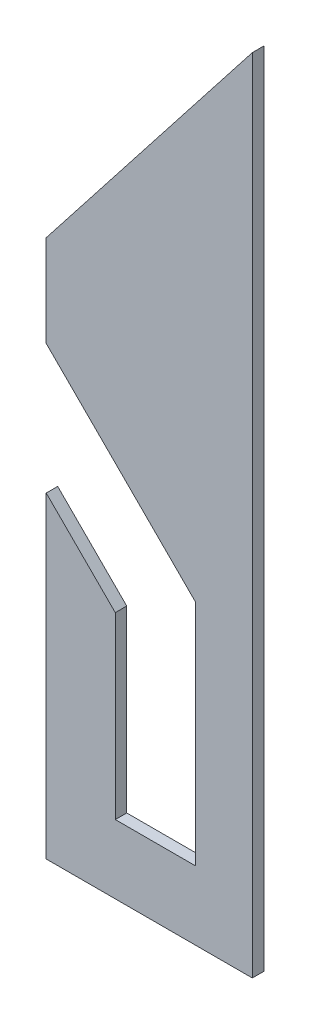
ISO-10303-21;
HEADER;
FILE_DESCRIPTION(('STEP AP214'),'2;1');
FILE_NAME('part.step','',(''),(''),'','','');
FILE_SCHEMA(('AUTOMOTIVE_DESIGN { 1 0 10303 214 1 1 1 1 }'));
ENDSEC;
DATA;
#1=APPLICATION_CONTEXT('core data for automotive mechanical design processes');
#2=APPLICATION_PROTOCOL_DEFINITION('international standard','automotive_design',2000,#1);
#3=PRODUCT_CONTEXT('',#1,'mechanical');
#4=PRODUCT('Part','Part','',(#3));
#5=PRODUCT_RELATED_PRODUCT_CATEGORY('part','',(#4));
#6=PRODUCT_DEFINITION_FORMATION('','',#4);
#7=PRODUCT_DEFINITION_CONTEXT('part definition',#1,'design');
#8=PRODUCT_DEFINITION('design','',#6,#7);
#9=PRODUCT_DEFINITION_SHAPE('','',#8);
#10=(LENGTH_UNIT() NAMED_UNIT(*) SI_UNIT(.MILLI.,.METRE.));
#11=(NAMED_UNIT(*) PLANE_ANGLE_UNIT() SI_UNIT($,.RADIAN.));
#12=(NAMED_UNIT(*) SI_UNIT($,.STERADIAN.) SOLID_ANGLE_UNIT());
#13=UNCERTAINTY_MEASURE_WITH_UNIT(LENGTH_MEASURE(1.E-05),#10,'distance_accuracy_value','');
#14=(GEOMETRIC_REPRESENTATION_CONTEXT(3) GLOBAL_UNCERTAINTY_ASSIGNED_CONTEXT((#13)) GLOBAL_UNIT_ASSIGNED_CONTEXT((#10,
#11,#12)) REPRESENTATION_CONTEXT('',''));
#15=CARTESIAN_POINT('',(0.,0.,0.));
#16=DIRECTION('',(0.,0.,1.));
#17=DIRECTION('',(1.,0.,0.));
#18=AXIS2_PLACEMENT_3D('',#15,#16,#17);
#19=CARTESIAN_POINT('',(0.,0.,5.));
#20=DIRECTION('',(1.,0.,0.));
#21=DIRECTION('',(0.,0.,-1.));
#22=AXIS2_PLACEMENT_3D('',#19,#20,#21);
#23=PLANE('',#22);
#24=DIRECTION('',(0.,-1.,0.));
#25=VECTOR('',#24,1.);
#26=CARTESIAN_POINT('',(0.,0.,0.));
#27=LINE('',#26,#25);
#28=CARTESIAN_POINT('',(0.,138.431457505076,0.));
#29=VERTEX_POINT('',#28);
#30=CARTESIAN_POINT('',(0.,0.,0.));
#31=VERTEX_POINT('',#30);
#32=EDGE_CURVE('E145',#29,#31,#27,.T.);
#33=ORIENTED_EDGE('',*,*,#32,.T.);
#34=DIRECTION('',(0.,0.,-1.));
#35=VECTOR('',#34,1.);
#36=CARTESIAN_POINT('',(0.,0.,5.));
#37=LINE('',#36,#35);
#38=CARTESIAN_POINT('',(0.,0.,5.));
#39=VERTEX_POINT('',#38);
#40=EDGE_CURVE('E11',#39,#31,#37,.T.);
#41=ORIENTED_EDGE('',*,*,#40,.F.);
#42=DIRECTION('',(0.,-1.,0.));
#43=VECTOR('',#42,1.);
#44=CARTESIAN_POINT('',(0.,0.,5.));
#45=LINE('',#44,#43);
#46=CARTESIAN_POINT('',(0.,138.431457505076,5.));
#47=VERTEX_POINT('',#46);
#48=EDGE_CURVE('E163',#47,#39,#45,.T.);
#49=ORIENTED_EDGE('',*,*,#48,.F.);
#50=DIRECTION('',(0.,0.,-1.));
#51=VECTOR('',#50,1.);
#52=CARTESIAN_POINT('',(0.,138.431457505076,5.));
#53=LINE('',#52,#51);
#54=EDGE_CURVE('E141',#47,#29,#53,.T.);
#55=ORIENTED_EDGE('',*,*,#54,.T.);
#56=EDGE_LOOP('',(#33,#41,#49,#55));
#57=FACE_BOUND('',#56,.T.);
#58=ADVANCED_FACE('F37',(#57),#23,.F.);
#59=CARTESIAN_POINT('',(0.,0.,5.));
#60=DIRECTION('',(0.,1.,0.));
#61=DIRECTION('',(0.,0.,1.));
#62=AXIS2_PLACEMENT_3D('',#59,#60,#61);
#63=PLANE('',#62);
#64=DIRECTION('',(1.,0.,0.));
#65=VECTOR('',#64,1.);
#66=CARTESIAN_POINT('',(0.,0.,0.));
#67=LINE('',#66,#65);
#68=CARTESIAN_POINT('',(90.,0.,0.));
#69=VERTEX_POINT('',#68);
#70=EDGE_CURVE('E148',#31,#69,#67,.T.);
#71=ORIENTED_EDGE('',*,*,#70,.T.);
#72=DIRECTION('',(0.,0.,-1.));
#73=VECTOR('',#72,1.);
#74=CARTESIAN_POINT('',(90.,0.,5.));
#75=LINE('',#74,#73);
#76=CARTESIAN_POINT('',(90.,0.,5.));
#77=VERTEX_POINT('',#76);
#78=EDGE_CURVE('E45',#77,#69,#75,.T.);
#79=ORIENTED_EDGE('',*,*,#78,.F.);
#80=DIRECTION('',(1.,0.,0.));
#81=VECTOR('',#80,1.);
#82=CARTESIAN_POINT('',(0.,0.,5.));
#83=LINE('',#82,#81);
#84=EDGE_CURVE('E102',#39,#77,#83,.T.);
#85=ORIENTED_EDGE('',*,*,#84,.F.);
#86=ORIENTED_EDGE('',*,*,#40,.T.);
#87=EDGE_LOOP('',(#71,#79,#85,#86));
#88=FACE_BOUND('',#87,.T.);
#89=ADVANCED_FACE('F212',(#88),#63,.F.);
#90=CARTESIAN_POINT('',(90.,0.,5.));
#91=DIRECTION('',(-1.,0.,0.));
#92=DIRECTION('',(0.,0.,1.));
#93=AXIS2_PLACEMENT_3D('',#90,#91,#92);
#94=PLANE('',#93);
#95=DIRECTION('',(0.,1.,0.));
#96=VECTOR('',#95,1.);
#97=CARTESIAN_POINT('',(90.,0.,0.));
#98=LINE('',#97,#96);
#99=CARTESIAN_POINT('',(90.,350.,0.));
#100=VERTEX_POINT('',#99);
#101=EDGE_CURVE('E150',#69,#100,#98,.T.);
#102=ORIENTED_EDGE('',*,*,#101,.T.);
#103=DIRECTION('',(0.,0.,-1.));
#104=VECTOR('',#103,1.);
#105=CARTESIAN_POINT('',(90.,350.,5.));
#106=LINE('',#105,#104);
#107=CARTESIAN_POINT('',(90.,350.,5.));
#108=VERTEX_POINT('',#107);
#109=EDGE_CURVE('E176',#108,#100,#106,.T.);
#110=ORIENTED_EDGE('',*,*,#109,.F.);
#111=DIRECTION('',(0.,1.,0.));
#112=VECTOR('',#111,1.);
#113=CARTESIAN_POINT('',(90.,0.,5.));
#114=LINE('',#113,#112);
#115=EDGE_CURVE('E184',#77,#108,#114,.T.);
#116=ORIENTED_EDGE('',*,*,#115,.F.);
#117=ORIENTED_EDGE('',*,*,#78,.T.);
#118=EDGE_LOOP('',(#102,#110,#116,#117));
#119=FACE_BOUND('',#118,.T.);
#120=ADVANCED_FACE('F182',(#119),#94,.F.);
#121=CARTESIAN_POINT('',(90.,350.,5.));
#122=DIRECTION('',(0.787505001007586,-0.616308261658111,0.));
#123=DIRECTION('',(0.616308261658111,0.787505001007586,0.));
#124=AXIS2_PLACEMENT_3D('',#121,#122,#123);
#125=PLANE('',#124);
#126=DIRECTION('',(-0.616308261658111,-0.787505001007586,0.));
#127=VECTOR('',#126,1.);
#128=CARTESIAN_POINT('',(90.,350.,0.));
#129=LINE('',#128,#127);
#130=CARTESIAN_POINT('',(0.,235.,0.));
#131=VERTEX_POINT('',#130);
#132=EDGE_CURVE('E152',#100,#131,#129,.T.);
#133=ORIENTED_EDGE('',*,*,#132,.T.);
#134=DIRECTION('',(0.,0.,-1.));
#135=VECTOR('',#134,1.);
#136=CARTESIAN_POINT('',(0.,235.,5.));
#137=LINE('',#136,#135);
#138=CARTESIAN_POINT('',(0.,235.,5.));
#139=VERTEX_POINT('',#138);
#140=EDGE_CURVE('E173',#139,#131,#137,.T.);
#141=ORIENTED_EDGE('',*,*,#140,.F.);
#142=DIRECTION('',(-0.616308261658111,-0.787505001007586,0.));
#143=VECTOR('',#142,1.);
#144=CARTESIAN_POINT('',(90.,350.,5.));
#145=LINE('',#144,#143);
#146=EDGE_CURVE('E202',#108,#139,#145,.T.);
#147=ORIENTED_EDGE('',*,*,#146,.F.);
#148=ORIENTED_EDGE('',*,*,#109,.T.);
#149=EDGE_LOOP('',(#133,#141,#147,#148));
#150=FACE_BOUND('',#149,.T.);
#151=ADVANCED_FACE('F193',(#150),#125,.F.);
#152=CARTESIAN_POINT('',(0.,195.,5.));
#153=DIRECTION('',(1.,0.,0.));
#154=DIRECTION('',(0.,0.,-1.));
#155=AXIS2_PLACEMENT_3D('',#152,#153,#154);
#156=PLANE('',#155);
#157=DIRECTION('',(0.,-1.,0.));
#158=VECTOR('',#157,1.);
#159=CARTESIAN_POINT('',(0.,195.,0.));
#160=LINE('',#159,#158);
#161=CARTESIAN_POINT('',(0.,195.,0.));
#162=VERTEX_POINT('',#161);
#163=EDGE_CURVE('E154',#131,#162,#160,.T.);
#164=ORIENTED_EDGE('',*,*,#163,.T.);
#165=DIRECTION('',(0.,0.,-1.));
#166=VECTOR('',#165,1.);
#167=CARTESIAN_POINT('',(0.,195.,5.));
#168=LINE('',#167,#166);
#169=CARTESIAN_POINT('',(0.,195.,5.));
#170=VERTEX_POINT('',#169);
#171=EDGE_CURVE('E170',#170,#162,#168,.T.);
#172=ORIENTED_EDGE('',*,*,#171,.F.);
#173=DIRECTION('',(0.,-1.,0.));
#174=VECTOR('',#173,1.);
#175=CARTESIAN_POINT('',(0.,195.,5.));
#176=LINE('',#175,#174);
#177=EDGE_CURVE('E199',#139,#170,#176,.T.);
#178=ORIENTED_EDGE('',*,*,#177,.F.);
#179=ORIENTED_EDGE('',*,*,#140,.T.);
#180=EDGE_LOOP('',(#164,#172,#178,#179));
#181=FACE_BOUND('',#180,.T.);
#182=ADVANCED_FACE('F197',(#181),#156,.F.);
#183=CARTESIAN_POINT('',(65.1589841274945,129.841015872505,5.));
#184=DIRECTION('',(0.707106781186551,0.707106781186544,0.));
#185=DIRECTION('',(-0.707106781186544,0.707106781186551,0.));
#186=AXIS2_PLACEMENT_3D('',#183,#184,#185);
#187=PLANE('',#186);
#188=DIRECTION('',(0.707106781186544,-0.707106781186551,0.));
#189=VECTOR('',#188,1.);
#190=CARTESIAN_POINT('',(65.1589841274945,129.841015872505,0.));
#191=LINE('',#190,#189);
#192=CARTESIAN_POINT('',(65.1589841274945,129.841015872505,0.));
#193=VERTEX_POINT('',#192);
#194=EDGE_CURVE('E156',#162,#193,#191,.T.);
#195=ORIENTED_EDGE('',*,*,#194,.T.);
#196=DIRECTION('',(0.,0.,-1.));
#197=VECTOR('',#196,1.);
#198=CARTESIAN_POINT('',(65.1589841274945,129.841015872505,5.));
#199=LINE('',#198,#197);
#200=CARTESIAN_POINT('',(65.1589841274945,129.841015872505,5.));
#201=VERTEX_POINT('',#200);
#202=EDGE_CURVE('E167',#201,#193,#199,.T.);
#203=ORIENTED_EDGE('',*,*,#202,.F.);
#204=DIRECTION('',(0.707106781186544,-0.707106781186551,0.));
#205=VECTOR('',#204,1.);
#206=CARTESIAN_POINT('',(65.1589841274945,129.841015872505,5.));
#207=LINE('',#206,#205);
#208=EDGE_CURVE('E201',#170,#201,#207,.T.);
#209=ORIENTED_EDGE('',*,*,#208,.F.);
#210=ORIENTED_EDGE('',*,*,#171,.T.);
#211=EDGE_LOOP('',(#195,#203,#209,#210));
#212=FACE_BOUND('',#211,.T.);
#213=ADVANCED_FACE('F224',(#212),#187,.F.);
#214=CARTESIAN_POINT('',(65.1589841274945,30.,5.));
#215=DIRECTION('',(1.,0.,0.));
#216=DIRECTION('',(0.,1.,0.));
#217=AXIS2_PLACEMENT_3D('',#214,#215,#216);
#218=PLANE('',#217);
#219=DIRECTION('',(0.,-1.,0.));
#220=VECTOR('',#219,1.);
#221=CARTESIAN_POINT('',(65.1589841274945,30.,0.));
#222=LINE('',#221,#220);
#223=CARTESIAN_POINT('',(65.1589841274945,30.,0.));
#224=VERTEX_POINT('',#223);
#225=EDGE_CURVE('E158',#193,#224,#222,.T.);
#226=ORIENTED_EDGE('',*,*,#225,.T.);
#227=DIRECTION('',(0.,0.,-1.));
#228=VECTOR('',#227,1.);
#229=CARTESIAN_POINT('',(65.1589841274945,30.,5.));
#230=LINE('',#229,#228);
#231=CARTESIAN_POINT('',(65.1589841274945,30.,5.));
#232=VERTEX_POINT('',#231);
#233=EDGE_CURVE('E136',#232,#224,#230,.T.);
#234=ORIENTED_EDGE('',*,*,#233,.F.);
#235=DIRECTION('',(0.,-1.,0.));
#236=VECTOR('',#235,1.);
#237=CARTESIAN_POINT('',(65.1589841274945,30.,5.));
#238=LINE('',#237,#236);
#239=EDGE_CURVE('E127',#201,#232,#238,.T.);
#240=ORIENTED_EDGE('',*,*,#239,.F.);
#241=ORIENTED_EDGE('',*,*,#202,.T.);
#242=EDGE_LOOP('',(#226,#234,#240,#241));
#243=FACE_BOUND('',#242,.T.);
#244=ADVANCED_FACE('F227',(#243),#218,.F.);
#245=CARTESIAN_POINT('',(30.1589841274945,30.,5.));
#246=DIRECTION('',(0.,-1.,0.));
#247=DIRECTION('',(0.,0.,-1.));
#248=AXIS2_PLACEMENT_3D('',#245,#246,#247);
#249=PLANE('',#248);
#250=DIRECTION('',(-1.,0.,0.));
#251=VECTOR('',#250,1.);
#252=CARTESIAN_POINT('',(30.1589841274945,30.,0.));
#253=LINE('',#252,#251);
#254=CARTESIAN_POINT('',(30.1589841274945,30.,0.));
#255=VERTEX_POINT('',#254);
#256=EDGE_CURVE('E135',#224,#255,#253,.T.);
#257=ORIENTED_EDGE('',*,*,#256,.T.);
#258=DIRECTION('',(0.,0.,-1.));
#259=VECTOR('',#258,1.);
#260=CARTESIAN_POINT('',(30.1589841274945,30.,5.));
#261=LINE('',#260,#259);
#262=CARTESIAN_POINT('',(30.1589841274945,30.,5.));
#263=VERTEX_POINT('',#262);
#264=EDGE_CURVE('E132',#263,#255,#261,.T.);
#265=ORIENTED_EDGE('',*,*,#264,.F.);
#266=DIRECTION('',(-1.,0.,0.));
#267=VECTOR('',#266,1.);
#268=CARTESIAN_POINT('',(30.1589841274945,30.,5.));
#269=LINE('',#268,#267);
#270=EDGE_CURVE('E121',#232,#263,#269,.T.);
#271=ORIENTED_EDGE('',*,*,#270,.F.);
#272=ORIENTED_EDGE('',*,*,#233,.T.);
#273=EDGE_LOOP('',(#257,#265,#271,#272));
#274=FACE_BOUND('',#273,.T.);
#275=ADVANCED_FACE('F133',(#274),#249,.F.);
#276=CARTESIAN_POINT('',(30.1589841274945,108.272473377581,5.));
#277=DIRECTION('',(-1.,0.,0.));
#278=DIRECTION('',(0.,-1.,0.));
#279=AXIS2_PLACEMENT_3D('',#276,#277,#278);
#280=PLANE('',#279);
#281=DIRECTION('',(0.,1.,0.));
#282=VECTOR('',#281,1.);
#283=CARTESIAN_POINT('',(30.1589841274945,108.272473377581,0.));
#284=LINE('',#283,#282);
#285=CARTESIAN_POINT('',(30.1589841274945,108.272473377581,0.));
#286=VERTEX_POINT('',#285);
#287=EDGE_CURVE('E88',#255,#286,#284,.T.);
#288=ORIENTED_EDGE('',*,*,#287,.T.);
#289=DIRECTION('',(0.,0.,-1.));
#290=VECTOR('',#289,1.);
#291=CARTESIAN_POINT('',(30.1589841274945,108.272473377581,5.));
#292=LINE('',#291,#290);
#293=CARTESIAN_POINT('',(30.1589841274945,108.272473377581,5.));
#294=VERTEX_POINT('',#293);
#295=EDGE_CURVE('E137',#294,#286,#292,.T.);
#296=ORIENTED_EDGE('',*,*,#295,.F.);
#297=DIRECTION('',(0.,1.,0.));
#298=VECTOR('',#297,1.);
#299=CARTESIAN_POINT('',(30.1589841274945,108.272473377581,5.));
#300=LINE('',#299,#298);
#301=EDGE_CURVE('E125',#263,#294,#300,.T.);
#302=ORIENTED_EDGE('',*,*,#301,.F.);
#303=ORIENTED_EDGE('',*,*,#264,.T.);
#304=EDGE_LOOP('',(#288,#296,#302,#303));
#305=FACE_BOUND('',#304,.T.);
#306=ADVANCED_FACE('F139',(#305),#280,.F.);
#307=CARTESIAN_POINT('',(0.,138.431457505076,5.));
#308=DIRECTION('',(-0.707106781186551,-0.707106781186544,0.));
#309=DIRECTION('',(0.707106781186544,-0.707106781186551,0.));
#310=AXIS2_PLACEMENT_3D('',#307,#308,#309);
#311=PLANE('',#310);
#312=DIRECTION('',(-0.707106781186544,0.707106781186551,0.));
#313=VECTOR('',#312,1.);
#314=CARTESIAN_POINT('',(0.,138.431457505076,0.));
#315=LINE('',#314,#313);
#316=EDGE_CURVE('E94',#286,#29,#315,.T.);
#317=ORIENTED_EDGE('',*,*,#316,.T.);
#318=ORIENTED_EDGE('',*,*,#54,.F.);
#319=DIRECTION('',(-0.707106781186544,0.707106781186551,0.));
#320=VECTOR('',#319,1.);
#321=CARTESIAN_POINT('',(0.,138.431457505076,5.));
#322=LINE('',#321,#320);
#323=EDGE_CURVE('E53',#294,#47,#322,.T.);
#324=ORIENTED_EDGE('',*,*,#323,.F.);
#325=ORIENTED_EDGE('',*,*,#295,.T.);
#326=EDGE_LOOP('',(#317,#318,#324,#325));
#327=FACE_BOUND('',#326,.T.);
#328=ADVANCED_FACE('F236',(#327),#311,.F.);
#329=CARTESIAN_POINT('',(0.,0.,5.));
#330=DIRECTION('',(0.,0.,-1.));
#331=DIRECTION('',(-1.,0.,0.));
#332=AXIS2_PLACEMENT_3D('',#329,#330,#331);
#333=PLANE('',#332);
#334=ORIENTED_EDGE('',*,*,#48,.T.);
#335=ORIENTED_EDGE('',*,*,#84,.T.);
#336=ORIENTED_EDGE('',*,*,#115,.T.);
#337=ORIENTED_EDGE('',*,*,#146,.T.);
#338=ORIENTED_EDGE('',*,*,#177,.T.);
#339=ORIENTED_EDGE('',*,*,#208,.T.);
#340=ORIENTED_EDGE('',*,*,#239,.T.);
#341=ORIENTED_EDGE('',*,*,#270,.T.);
#342=ORIENTED_EDGE('',*,*,#301,.T.);
#343=ORIENTED_EDGE('',*,*,#323,.T.);
#344=EDGE_LOOP('',(#334,#335,#336,#337,#338,#339,#340,#341,#342,#343));
#345=FACE_BOUND('',#344,.T.);
#346=ADVANCED_FACE('F123',(#345),#333,.F.);
#347=CARTESIAN_POINT('',(0.,0.,0.));
#348=DIRECTION('',(0.,0.,-1.));
#349=DIRECTION('',(-1.,0.,0.));
#350=AXIS2_PLACEMENT_3D('',#347,#348,#349);
#351=PLANE('',#350);
#352=ORIENTED_EDGE('',*,*,#32,.F.);
#353=ORIENTED_EDGE('',*,*,#316,.F.);
#354=ORIENTED_EDGE('',*,*,#287,.F.);
#355=ORIENTED_EDGE('',*,*,#256,.F.);
#356=ORIENTED_EDGE('',*,*,#225,.F.);
#357=ORIENTED_EDGE('',*,*,#194,.F.);
#358=ORIENTED_EDGE('',*,*,#163,.F.);
#359=ORIENTED_EDGE('',*,*,#132,.F.);
#360=ORIENTED_EDGE('',*,*,#101,.F.);
#361=ORIENTED_EDGE('',*,*,#70,.F.);
#362=EDGE_LOOP('',(#352,#353,#354,#355,#356,#357,#358,#359,#360,#361));
#363=FACE_BOUND('',#362,.T.);
#364=ADVANCED_FACE('F188',(#363),#351,.T.);
#365=CLOSED_SHELL('',(#58,#89,#120,#151,#182,#213,#244,#275,#306,#328,#346,#364));
#366=MANIFOLD_SOLID_BREP('B2',#365);
#367=ADVANCED_BREP_SHAPE_REPRESENTATION('',(#18,#366),#14);
#368=SHAPE_DEFINITION_REPRESENTATION(#9,#367);
ENDSEC;
END-ISO-10303-21;
